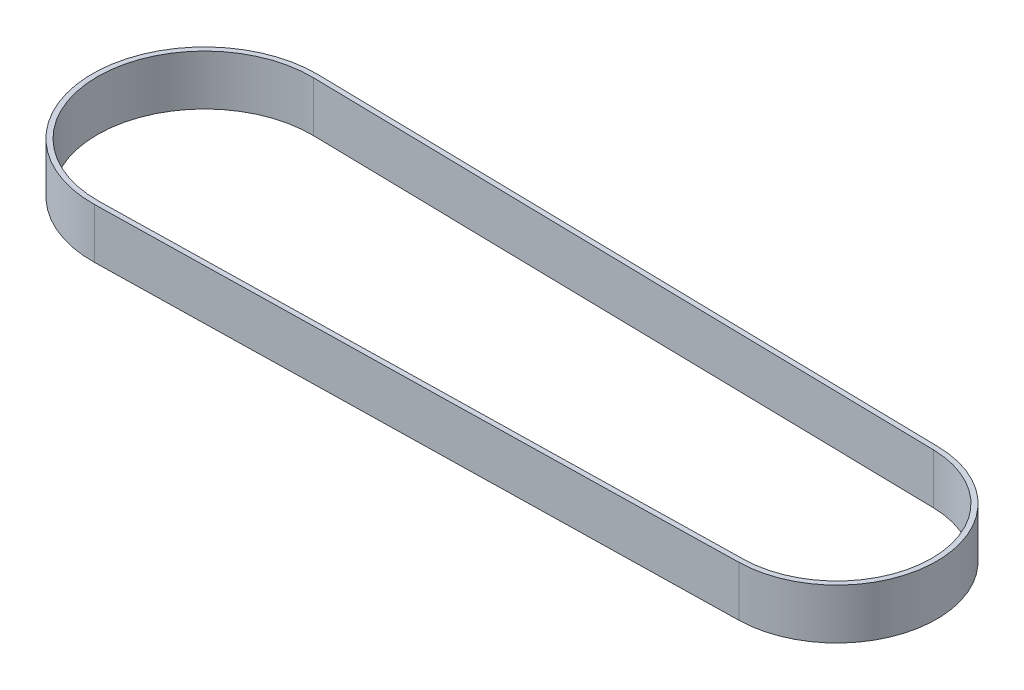
ISO-10303-21;
HEADER;
FILE_DESCRIPTION(('STEP AP214'),'2;1');
FILE_NAME('part.step','',(''),(''),'','','');
FILE_SCHEMA(('AUTOMOTIVE_DESIGN { 1 0 10303 214 1 1 1 1 }'));
ENDSEC;
DATA;
#1=APPLICATION_CONTEXT('core data for automotive mechanical design processes');
#2=APPLICATION_PROTOCOL_DEFINITION('international standard','automotive_design',2000,#1);
#3=PRODUCT_CONTEXT('',#1,'mechanical');
#4=PRODUCT('Part','Part','',(#3));
#5=PRODUCT_RELATED_PRODUCT_CATEGORY('part','',(#4));
#6=PRODUCT_DEFINITION_FORMATION('','',#4);
#7=PRODUCT_DEFINITION_CONTEXT('part definition',#1,'design');
#8=PRODUCT_DEFINITION('design','',#6,#7);
#9=PRODUCT_DEFINITION_SHAPE('','',#8);
#10=(LENGTH_UNIT() NAMED_UNIT(*) SI_UNIT(.MILLI.,.METRE.));
#11=(NAMED_UNIT(*) PLANE_ANGLE_UNIT() SI_UNIT($,.RADIAN.));
#12=(NAMED_UNIT(*) SI_UNIT($,.STERADIAN.) SOLID_ANGLE_UNIT());
#13=UNCERTAINTY_MEASURE_WITH_UNIT(LENGTH_MEASURE(1.E-05),#10,'distance_accuracy_value','');
#14=(GEOMETRIC_REPRESENTATION_CONTEXT(3) GLOBAL_UNCERTAINTY_ASSIGNED_CONTEXT((#13)) GLOBAL_UNIT_ASSIGNED_CONTEXT((#10,
#11,#12)) REPRESENTATION_CONTEXT('',''));
#15=CARTESIAN_POINT('',(0.,0.,0.));
#16=DIRECTION('',(0.,0.,1.));
#17=DIRECTION('',(1.,0.,0.));
#18=AXIS2_PLACEMENT_3D('',#15,#16,#17);
#19=CARTESIAN_POINT('',(0.,10.,0.));
#20=DIRECTION('',(0.,1.,0.));
#21=DIRECTION('',(0.,0.,1.));
#22=AXIS2_PLACEMENT_3D('',#19,#20,#21);
#23=PLANE('',#22);
#24=CARTESIAN_POINT('',(0.,10.,0.));
#25=DIRECTION('',(0.,1.,0.));
#26=DIRECTION('',(0.,0.,1.));
#27=AXIS2_PLACEMENT_3D('',#24,#25,#26);
#28=CIRCLE('',#27,22.35);
#29=CARTESIAN_POINT('',(0.434583333333333,10.,-22.345774484819));
#30=VERTEX_POINT('',#29);
#31=CARTESIAN_POINT('',(0.434583333333333,10.,22.345774484819));
#32=VERTEX_POINT('',#31);
#33=EDGE_CURVE('E133',#30,#32,#28,.T.);
#34=ORIENTED_EDGE('',*,*,#33,.T.);
#35=DIRECTION('',(0.999810938918077,0.,-0.0194444444444444));
#36=VECTOR('',#35,1.);
#37=CARTESIAN_POINT('',(0.434583333333333,10.,22.345774484819));
#38=LINE('',#37,#36);
#39=CARTESIAN_POINT('',(126.386944444444,10.,19.8962376844697));
#40=VERTEX_POINT('',#39);
#41=EDGE_CURVE('E136',#32,#40,#38,.T.);
#42=ORIENTED_EDGE('',*,*,#41,.T.);
#43=CARTESIAN_POINT('',(126.,10.,0.));
#44=DIRECTION('',(0.,1.,0.));
#45=DIRECTION('',(0.,0.,1.));
#46=AXIS2_PLACEMENT_3D('',#43,#44,#45);
#47=CIRCLE('',#46,19.9);
#48=CARTESIAN_POINT('',(126.386944444444,10.,-19.8962376844697));
#49=VERTEX_POINT('',#48);
#50=EDGE_CURVE('E139',#40,#49,#47,.T.);
#51=ORIENTED_EDGE('',*,*,#50,.T.);
#52=DIRECTION('',(-0.999810938918077,0.,-0.0194444444444444));
#53=VECTOR('',#52,1.);
#54=CARTESIAN_POINT('',(0.434583333333333,10.,-22.345774484819));
#55=LINE('',#54,#53);
#56=EDGE_CURVE('E141',#49,#30,#55,.T.);
#57=ORIENTED_EDGE('',*,*,#56,.T.);
#58=EDGE_LOOP('',(#34,#42,#51,#57));
#59=FACE_BOUND('',#58,.T.);
#60=DIRECTION('',(0.999810938918077,0.,-0.0194444444444444));
#61=VECTOR('',#60,1.);
#62=CARTESIAN_POINT('',(0.415138888888889,10.,21.3459635459009));
#63=LINE('',#62,#61);
#64=CARTESIAN_POINT('',(0.415138888888889,10.,21.3459635459009));
#65=VERTEX_POINT('',#64);
#66=CARTESIAN_POINT('',(126.3675,10.,18.8964267455517));
#67=VERTEX_POINT('',#66);
#68=EDGE_CURVE('E105',#65,#67,#63,.T.);
#69=ORIENTED_EDGE('',*,*,#68,.F.);
#70=CARTESIAN_POINT('',(0.,10.,0.));
#71=DIRECTION('',(0.,1.,0.));
#72=DIRECTION('',(0.,0.,1.));
#73=AXIS2_PLACEMENT_3D('',#70,#71,#72);
#74=CIRCLE('',#73,21.35);
#75=CARTESIAN_POINT('',(0.415138888888889,10.,-21.3459635459009));
#76=VERTEX_POINT('',#75);
#77=EDGE_CURVE('E97',#76,#65,#74,.T.);
#78=ORIENTED_EDGE('',*,*,#77,.F.);
#79=DIRECTION('',(-0.999810938918077,0.,-0.0194444444444444));
#80=VECTOR('',#79,1.);
#81=CARTESIAN_POINT('',(0.415138888888889,10.,-21.3459635459009));
#82=LINE('',#81,#80);
#83=CARTESIAN_POINT('',(126.3675,10.,-18.8964267455517));
#84=VERTEX_POINT('',#83);
#85=EDGE_CURVE('E119',#84,#76,#82,.T.);
#86=ORIENTED_EDGE('',*,*,#85,.F.);
#87=CARTESIAN_POINT('',(126.,10.,0.));
#88=DIRECTION('',(0.,1.,0.));
#89=DIRECTION('',(0.,0.,1.));
#90=AXIS2_PLACEMENT_3D('',#87,#88,#89);
#91=CIRCLE('',#90,18.9);
#92=EDGE_CURVE('E117',#67,#84,#91,.T.);
#93=ORIENTED_EDGE('',*,*,#92,.F.);
#94=EDGE_LOOP('',(#69,#78,#86,#93));
#95=FACE_BOUND('',#94,.T.);
#96=ADVANCED_FACE('F32',(#59,#95),#23,.T.);
#97=CARTESIAN_POINT('',(0.,0.,0.));
#98=DIRECTION('',(0.,1.,0.));
#99=DIRECTION('',(0.,0.,1.));
#100=AXIS2_PLACEMENT_3D('',#97,#98,#99);
#101=PLANE('',#100);
#102=CARTESIAN_POINT('',(0.,0.,0.));
#103=DIRECTION('',(0.,1.,0.));
#104=DIRECTION('',(0.,0.,1.));
#105=AXIS2_PLACEMENT_3D('',#102,#103,#104);
#106=CIRCLE('',#105,22.35);
#107=CARTESIAN_POINT('',(0.434583333333333,0.,-22.345774484819));
#108=VERTEX_POINT('',#107);
#109=CARTESIAN_POINT('',(0.434583333333333,0.,22.345774484819));
#110=VERTEX_POINT('',#109);
#111=EDGE_CURVE('E113',#108,#110,#106,.T.);
#112=ORIENTED_EDGE('',*,*,#111,.F.);
#113=DIRECTION('',(-0.999810938918077,0.,-0.0194444444444444));
#114=VECTOR('',#113,1.);
#115=CARTESIAN_POINT('',(0.434583333333333,0.,-22.345774484819));
#116=LINE('',#115,#114);
#117=CARTESIAN_POINT('',(126.386944444444,0.,-19.8962376844697));
#118=VERTEX_POINT('',#117);
#119=EDGE_CURVE('E137',#118,#108,#116,.T.);
#120=ORIENTED_EDGE('',*,*,#119,.F.);
#121=CARTESIAN_POINT('',(126.,0.,0.));
#122=DIRECTION('',(0.,1.,0.));
#123=DIRECTION('',(0.,0.,1.));
#124=AXIS2_PLACEMENT_3D('',#121,#122,#123);
#125=CIRCLE('',#124,19.9);
#126=CARTESIAN_POINT('',(126.386944444444,0.,19.8962376844697));
#127=VERTEX_POINT('',#126);
#128=EDGE_CURVE('E148',#127,#118,#125,.T.);
#129=ORIENTED_EDGE('',*,*,#128,.F.);
#130=DIRECTION('',(0.999810938918077,0.,-0.0194444444444444));
#131=VECTOR('',#130,1.);
#132=CARTESIAN_POINT('',(0.434583333333333,0.,22.345774484819));
#133=LINE('',#132,#131);
#134=EDGE_CURVE('E146',#110,#127,#133,.T.);
#135=ORIENTED_EDGE('',*,*,#134,.F.);
#136=EDGE_LOOP('',(#112,#120,#129,#135));
#137=FACE_BOUND('',#136,.T.);
#138=CARTESIAN_POINT('',(0.,0.,0.));
#139=DIRECTION('',(0.,1.,0.));
#140=DIRECTION('',(0.,0.,1.));
#141=AXIS2_PLACEMENT_3D('',#138,#139,#140);
#142=CIRCLE('',#141,21.35);
#143=CARTESIAN_POINT('',(0.415138888888889,0.,-21.3459635459009));
#144=VERTEX_POINT('',#143);
#145=CARTESIAN_POINT('',(0.415138888888889,0.,21.3459635459009));
#146=VERTEX_POINT('',#145);
#147=EDGE_CURVE('E55',#144,#146,#142,.T.);
#148=ORIENTED_EDGE('',*,*,#147,.T.);
#149=DIRECTION('',(0.999810938918077,0.,-0.0194444444444444));
#150=VECTOR('',#149,1.);
#151=CARTESIAN_POINT('',(0.415138888888889,0.,21.3459635459009));
#152=LINE('',#151,#150);
#153=CARTESIAN_POINT('',(126.3675,0.,18.8964267455517));
#154=VERTEX_POINT('',#153);
#155=EDGE_CURVE('E112',#146,#154,#152,.T.);
#156=ORIENTED_EDGE('',*,*,#155,.T.);
#157=CARTESIAN_POINT('',(126.,0.,0.));
#158=DIRECTION('',(0.,1.,0.));
#159=DIRECTION('',(0.,0.,1.));
#160=AXIS2_PLACEMENT_3D('',#157,#158,#159);
#161=CIRCLE('',#160,18.9);
#162=CARTESIAN_POINT('',(126.3675,0.,-18.8964267455517));
#163=VERTEX_POINT('',#162);
#164=EDGE_CURVE('E125',#154,#163,#161,.T.);
#165=ORIENTED_EDGE('',*,*,#164,.T.);
#166=DIRECTION('',(-0.999810938918077,0.,-0.0194444444444444));
#167=VECTOR('',#166,1.);
#168=CARTESIAN_POINT('',(0.415138888888889,0.,-21.3459635459009));
#169=LINE('',#168,#167);
#170=EDGE_CURVE('E106',#163,#144,#169,.T.);
#171=ORIENTED_EDGE('',*,*,#170,.T.);
#172=EDGE_LOOP('',(#148,#156,#165,#171));
#173=FACE_BOUND('',#172,.T.);
#174=ADVANCED_FACE('F166',(#137,#173),#101,.F.);
#175=CARTESIAN_POINT('',(0.,10.,0.));
#176=DIRECTION('',(0.,-1.,0.));
#177=DIRECTION('',(0.,0.,-1.));
#178=AXIS2_PLACEMENT_3D('',#175,#176,#177);
#179=CYLINDRICAL_SURFACE('',#178,22.35);
#180=ORIENTED_EDGE('',*,*,#111,.T.);
#181=DIRECTION('',(0.,-1.,0.));
#182=VECTOR('',#181,1.);
#183=CARTESIAN_POINT('',(0.434583333333333,10.,22.345774484819));
#184=LINE('',#183,#182);
#185=EDGE_CURVE('E11',#32,#110,#184,.T.);
#186=ORIENTED_EDGE('',*,*,#185,.F.);
#187=ORIENTED_EDGE('',*,*,#33,.F.);
#188=DIRECTION('',(0.,-1.,0.));
#189=VECTOR('',#188,1.);
#190=CARTESIAN_POINT('',(0.434583333333333,10.,-22.345774484819));
#191=LINE('',#190,#189);
#192=EDGE_CURVE('E143',#30,#108,#191,.T.);
#193=ORIENTED_EDGE('',*,*,#192,.T.);
#194=EDGE_LOOP('',(#180,#186,#187,#193));
#195=FACE_BOUND('',#194,.T.);
#196=ADVANCED_FACE('F34',(#195),#179,.T.);
#197=CARTESIAN_POINT('',(0.434583333333333,10.,22.345774484819));
#198=DIRECTION('',(-0.0194444444444444,0.,-0.999810938918077));
#199=DIRECTION('',(-0.999810938918077,0.,0.0194444444444444));
#200=AXIS2_PLACEMENT_3D('',#197,#198,#199);
#201=PLANE('',#200);
#202=ORIENTED_EDGE('',*,*,#134,.T.);
#203=DIRECTION('',(0.,-1.,0.));
#204=VECTOR('',#203,1.);
#205=CARTESIAN_POINT('',(126.386944444444,10.,19.8962376844697));
#206=LINE('',#205,#204);
#207=EDGE_CURVE('E40',#40,#127,#206,.T.);
#208=ORIENTED_EDGE('',*,*,#207,.F.);
#209=ORIENTED_EDGE('',*,*,#41,.F.);
#210=ORIENTED_EDGE('',*,*,#185,.T.);
#211=EDGE_LOOP('',(#202,#208,#209,#210));
#212=FACE_BOUND('',#211,.T.);
#213=ADVANCED_FACE('F176',(#212),#201,.F.);
#214=CARTESIAN_POINT('',(126.,10.,0.));
#215=DIRECTION('',(0.,-1.,0.));
#216=DIRECTION('',(0.,0.,-1.));
#217=AXIS2_PLACEMENT_3D('',#214,#215,#216);
#218=CYLINDRICAL_SURFACE('',#217,19.9);
#219=ORIENTED_EDGE('',*,*,#128,.T.);
#220=DIRECTION('',(0.,-1.,0.));
#221=VECTOR('',#220,1.);
#222=CARTESIAN_POINT('',(126.386944444444,10.,-19.8962376844697));
#223=LINE('',#222,#221);
#224=EDGE_CURVE('E153',#49,#118,#223,.T.);
#225=ORIENTED_EDGE('',*,*,#224,.F.);
#226=ORIENTED_EDGE('',*,*,#50,.F.);
#227=ORIENTED_EDGE('',*,*,#207,.T.);
#228=EDGE_LOOP('',(#219,#225,#226,#227));
#229=FACE_BOUND('',#228,.T.);
#230=ADVANCED_FACE('F160',(#229),#218,.T.);
#231=CARTESIAN_POINT('',(0.434583333333333,10.,-22.345774484819));
#232=DIRECTION('',(-0.0194444444444444,0.,0.999810938918077));
#233=DIRECTION('',(0.999810938918077,0.,0.0194444444444444));
#234=AXIS2_PLACEMENT_3D('',#231,#232,#233);
#235=PLANE('',#234);
#236=ORIENTED_EDGE('',*,*,#119,.T.);
#237=ORIENTED_EDGE('',*,*,#192,.F.);
#238=ORIENTED_EDGE('',*,*,#56,.F.);
#239=ORIENTED_EDGE('',*,*,#224,.T.);
#240=EDGE_LOOP('',(#236,#237,#238,#239));
#241=FACE_BOUND('',#240,.T.);
#242=ADVANCED_FACE('F170',(#241),#235,.F.);
#243=CARTESIAN_POINT('',(0.,10.,0.));
#244=DIRECTION('',(0.,-1.,0.));
#245=DIRECTION('',(0.,0.,-1.));
#246=AXIS2_PLACEMENT_3D('',#243,#244,#245);
#247=CYLINDRICAL_SURFACE('',#246,21.35);
#248=ORIENTED_EDGE('',*,*,#147,.F.);
#249=DIRECTION('',(0.,-1.,0.));
#250=VECTOR('',#249,1.);
#251=CARTESIAN_POINT('',(0.415138888888889,10.,-21.3459635459009));
#252=LINE('',#251,#250);
#253=EDGE_CURVE('E101',#76,#144,#252,.T.);
#254=ORIENTED_EDGE('',*,*,#253,.F.);
#255=ORIENTED_EDGE('',*,*,#77,.T.);
#256=DIRECTION('',(0.,-1.,0.));
#257=VECTOR('',#256,1.);
#258=CARTESIAN_POINT('',(0.415138888888889,10.,21.3459635459009));
#259=LINE('',#258,#257);
#260=EDGE_CURVE('E100',#65,#146,#259,.T.);
#261=ORIENTED_EDGE('',*,*,#260,.T.);
#262=EDGE_LOOP('',(#248,#254,#255,#261));
#263=FACE_BOUND('',#262,.T.);
#264=ADVANCED_FACE('F99',(#263),#247,.F.);
#265=CARTESIAN_POINT('',(0.415138888888889,10.,21.3459635459009));
#266=DIRECTION('',(-0.0194444444444444,0.,-0.999810938918077));
#267=DIRECTION('',(-0.999810938918077,0.,0.0194444444444444));
#268=AXIS2_PLACEMENT_3D('',#265,#266,#267);
#269=PLANE('',#268);
#270=ORIENTED_EDGE('',*,*,#155,.F.);
#271=ORIENTED_EDGE('',*,*,#260,.F.);
#272=ORIENTED_EDGE('',*,*,#68,.T.);
#273=DIRECTION('',(0.,-1.,0.));
#274=VECTOR('',#273,1.);
#275=CARTESIAN_POINT('',(126.3675,10.,18.8964267455517));
#276=LINE('',#275,#274);
#277=EDGE_CURVE('E114',#67,#154,#276,.T.);
#278=ORIENTED_EDGE('',*,*,#277,.T.);
#279=EDGE_LOOP('',(#270,#271,#272,#278));
#280=FACE_BOUND('',#279,.T.);
#281=ADVANCED_FACE('F109',(#280),#269,.T.);
#282=CARTESIAN_POINT('',(126.,10.,0.));
#283=DIRECTION('',(0.,-1.,0.));
#284=DIRECTION('',(0.,0.,-1.));
#285=AXIS2_PLACEMENT_3D('',#282,#283,#284);
#286=CYLINDRICAL_SURFACE('',#285,18.9);
#287=ORIENTED_EDGE('',*,*,#164,.F.);
#288=ORIENTED_EDGE('',*,*,#277,.F.);
#289=ORIENTED_EDGE('',*,*,#92,.T.);
#290=DIRECTION('',(0.,-1.,0.));
#291=VECTOR('',#290,1.);
#292=CARTESIAN_POINT('',(126.3675,10.,-18.8964267455517));
#293=LINE('',#292,#291);
#294=EDGE_CURVE('E47',#84,#163,#293,.T.);
#295=ORIENTED_EDGE('',*,*,#294,.T.);
#296=EDGE_LOOP('',(#287,#288,#289,#295));
#297=FACE_BOUND('',#296,.T.);
#298=ADVANCED_FACE('F199',(#297),#286,.F.);
#299=CARTESIAN_POINT('',(0.415138888888889,10.,-21.3459635459009));
#300=DIRECTION('',(-0.0194444444444444,0.,0.999810938918077));
#301=DIRECTION('',(0.999810938918077,0.,0.0194444444444444));
#302=AXIS2_PLACEMENT_3D('',#299,#300,#301);
#303=PLANE('',#302);
#304=ORIENTED_EDGE('',*,*,#170,.F.);
#305=ORIENTED_EDGE('',*,*,#294,.F.);
#306=ORIENTED_EDGE('',*,*,#85,.T.);
#307=ORIENTED_EDGE('',*,*,#253,.T.);
#308=EDGE_LOOP('',(#304,#305,#306,#307));
#309=FACE_BOUND('',#308,.T.);
#310=ADVANCED_FACE('F203',(#309),#303,.T.);
#311=CLOSED_SHELL('',(#96,#174,#196,#213,#230,#242,#264,#281,#298,#310));
#312=MANIFOLD_SOLID_BREP('B2',#311);
#313=ADVANCED_BREP_SHAPE_REPRESENTATION('',(#18,#312),#14);
#314=SHAPE_DEFINITION_REPRESENTATION(#9,#313);
ENDSEC;
END-ISO-10303-21;
